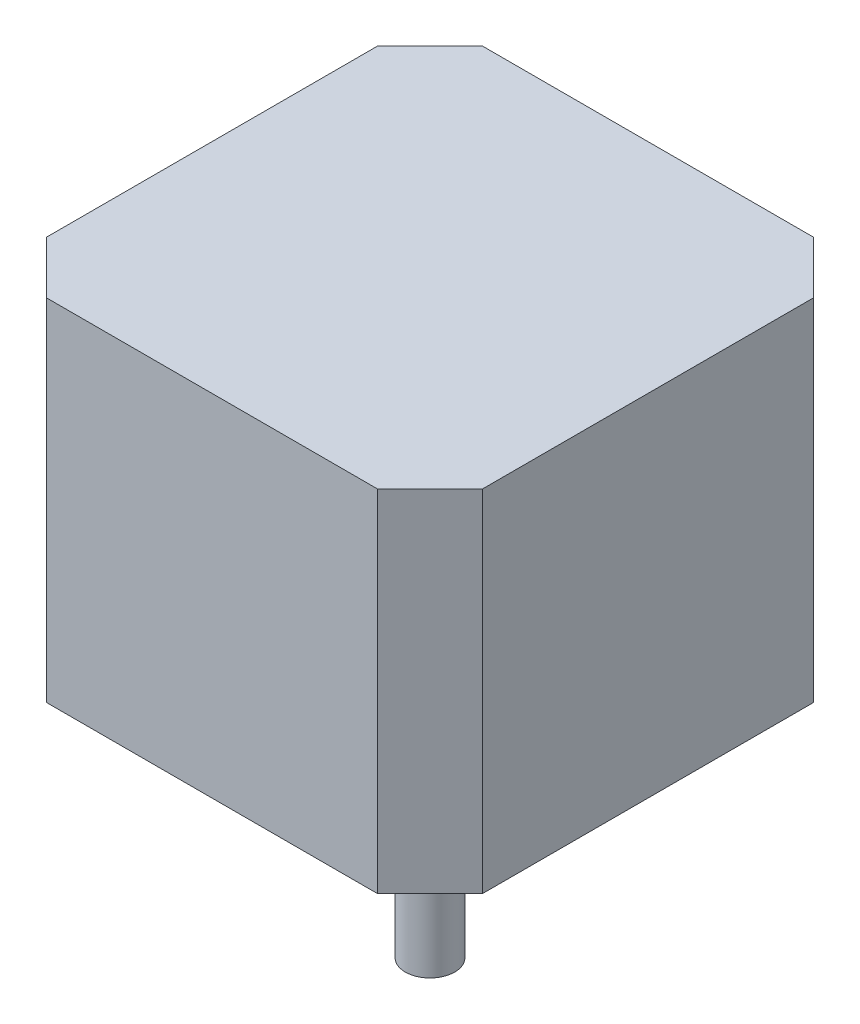
ISO-10303-21;
HEADER;
FILE_DESCRIPTION(('STEP AP214'),'2;1');
FILE_NAME('part.step','',(''),(''),'','','');
FILE_SCHEMA(('AUTOMOTIVE_DESIGN { 1 0 10303 214 1 1 1 1 }'));
ENDSEC;
DATA;
#1=APPLICATION_CONTEXT('core data for automotive mechanical design processes');
#2=APPLICATION_PROTOCOL_DEFINITION('international standard','automotive_design',2000,#1);
#3=PRODUCT_CONTEXT('',#1,'mechanical');
#4=PRODUCT('Part','Part','',(#3));
#5=PRODUCT_RELATED_PRODUCT_CATEGORY('part','',(#4));
#6=PRODUCT_DEFINITION_FORMATION('','',#4);
#7=PRODUCT_DEFINITION_CONTEXT('part definition',#1,'design');
#8=PRODUCT_DEFINITION('design','',#6,#7);
#9=PRODUCT_DEFINITION_SHAPE('','',#8);
#10=(LENGTH_UNIT() NAMED_UNIT(*) SI_UNIT(.MILLI.,.METRE.));
#11=(NAMED_UNIT(*) PLANE_ANGLE_UNIT() SI_UNIT($,.RADIAN.));
#12=(NAMED_UNIT(*) SI_UNIT($,.STERADIAN.) SOLID_ANGLE_UNIT());
#13=UNCERTAINTY_MEASURE_WITH_UNIT(LENGTH_MEASURE(1.E-05),#10,'distance_accuracy_value','');
#14=(GEOMETRIC_REPRESENTATION_CONTEXT(3) GLOBAL_UNCERTAINTY_ASSIGNED_CONTEXT((#13)) GLOBAL_UNIT_ASSIGNED_CONTEXT((#10,
#11,#12)) REPRESENTATION_CONTEXT('',''));
#15=CARTESIAN_POINT('',(0.,0.,0.));
#16=DIRECTION('',(0.,0.,1.));
#17=DIRECTION('',(1.,0.,0.));
#18=AXIS2_PLACEMENT_3D('',#15,#16,#17);
#19=CARTESIAN_POINT('',(-21.15,34.,-16.07));
#20=DIRECTION('',(0.707106781186547,0.,0.707106781186548));
#21=DIRECTION('',(0.707106781186548,0.,-0.707106781186547));
#22=AXIS2_PLACEMENT_3D('',#19,#20,#21);
#23=PLANE('',#22);
#24=DIRECTION('',(-0.707106781186548,0.,0.707106781186547));
#25=VECTOR('',#24,1.);
#26=CARTESIAN_POINT('',(-21.15,0.,-16.07));
#27=LINE('',#26,#25);
#28=CARTESIAN_POINT('',(-16.07,0.,-21.15));
#29=VERTEX_POINT('',#28);
#30=CARTESIAN_POINT('',(-21.15,0.,-16.07));
#31=VERTEX_POINT('',#30);
#32=EDGE_CURVE('E149',#29,#31,#27,.T.);
#33=ORIENTED_EDGE('',*,*,#32,.T.);
#34=DIRECTION('',(0.,-1.,0.));
#35=VECTOR('',#34,1.);
#36=CARTESIAN_POINT('',(-21.15,34.,-16.07));
#37=LINE('',#36,#35);
#38=CARTESIAN_POINT('',(-21.15,34.,-16.07));
#39=VERTEX_POINT('',#38);
#40=EDGE_CURVE('E44',#39,#31,#37,.T.);
#41=ORIENTED_EDGE('',*,*,#40,.F.);
#42=DIRECTION('',(-0.707106781186548,0.,0.707106781186547));
#43=VECTOR('',#42,1.);
#44=CARTESIAN_POINT('',(-21.15,34.,-16.07));
#45=LINE('',#44,#43);
#46=CARTESIAN_POINT('',(-16.07,34.,-21.15));
#47=VERTEX_POINT('',#46);
#48=EDGE_CURVE('E165',#47,#39,#45,.T.);
#49=ORIENTED_EDGE('',*,*,#48,.F.);
#50=DIRECTION('',(0.,-1.,0.));
#51=VECTOR('',#50,1.);
#52=CARTESIAN_POINT('',(-16.07,34.,-21.15));
#53=LINE('',#52,#51);
#54=EDGE_CURVE('E145',#47,#29,#53,.T.);
#55=ORIENTED_EDGE('',*,*,#54,.T.);
#56=EDGE_LOOP('',(#33,#41,#49,#55));
#57=FACE_BOUND('',#56,.T.);
#58=ADVANCED_FACE('F41',(#57),#23,.F.);
#59=CARTESIAN_POINT('',(-21.15,34.,16.07));
#60=DIRECTION('',(1.,0.,0.));
#61=DIRECTION('',(0.,0.,-1.));
#62=AXIS2_PLACEMENT_3D('',#59,#60,#61);
#63=PLANE('',#62);
#64=DIRECTION('',(0.,0.,1.));
#65=VECTOR('',#64,1.);
#66=CARTESIAN_POINT('',(-21.15,0.,16.07));
#67=LINE('',#66,#65);
#68=CARTESIAN_POINT('',(-21.15,0.,16.07));
#69=VERTEX_POINT('',#68);
#70=EDGE_CURVE('E152',#31,#69,#67,.T.);
#71=ORIENTED_EDGE('',*,*,#70,.T.);
#72=DIRECTION('',(0.,-1.,0.));
#73=VECTOR('',#72,1.);
#74=CARTESIAN_POINT('',(-21.15,34.,16.07));
#75=LINE('',#74,#73);
#76=CARTESIAN_POINT('',(-21.15,34.,16.07));
#77=VERTEX_POINT('',#76);
#78=EDGE_CURVE('E174',#77,#69,#75,.T.);
#79=ORIENTED_EDGE('',*,*,#78,.F.);
#80=DIRECTION('',(0.,0.,1.));
#81=VECTOR('',#80,1.);
#82=CARTESIAN_POINT('',(-21.15,34.,16.07));
#83=LINE('',#82,#81);
#84=EDGE_CURVE('E106',#39,#77,#83,.T.);
#85=ORIENTED_EDGE('',*,*,#84,.F.);
#86=ORIENTED_EDGE('',*,*,#40,.T.);
#87=EDGE_LOOP('',(#71,#79,#85,#86));
#88=FACE_BOUND('',#87,.T.);
#89=ADVANCED_FACE('F180',(#88),#63,.F.);
#90=CARTESIAN_POINT('',(-16.07,34.,21.15));
#91=DIRECTION('',(0.707106781186547,0.,-0.707106781186547));
#92=DIRECTION('',(-0.707106781186548,0.,-0.707106781186548));
#93=AXIS2_PLACEMENT_3D('',#90,#91,#92);
#94=PLANE('',#93);
#95=DIRECTION('',(0.707106781186548,0.,0.707106781186548));
#96=VECTOR('',#95,1.);
#97=CARTESIAN_POINT('',(-16.07,0.,21.15));
#98=LINE('',#97,#96);
#99=CARTESIAN_POINT('',(-16.07,0.,21.15));
#100=VERTEX_POINT('',#99);
#101=EDGE_CURVE('E155',#69,#100,#98,.T.);
#102=ORIENTED_EDGE('',*,*,#101,.T.);
#103=DIRECTION('',(0.,-1.,0.));
#104=VECTOR('',#103,1.);
#105=CARTESIAN_POINT('',(-16.07,34.,21.15));
#106=LINE('',#105,#104);
#107=CARTESIAN_POINT('',(-16.07,34.,21.15));
#108=VERTEX_POINT('',#107);
#109=EDGE_CURVE('E172',#108,#100,#106,.T.);
#110=ORIENTED_EDGE('',*,*,#109,.F.);
#111=DIRECTION('',(0.707106781186548,0.,0.707106781186548));
#112=VECTOR('',#111,1.);
#113=CARTESIAN_POINT('',(-16.07,34.,21.15));
#114=LINE('',#113,#112);
#115=EDGE_CURVE('E195',#77,#108,#114,.T.);
#116=ORIENTED_EDGE('',*,*,#115,.F.);
#117=ORIENTED_EDGE('',*,*,#78,.T.);
#118=EDGE_LOOP('',(#102,#110,#116,#117));
#119=FACE_BOUND('',#118,.T.);
#120=ADVANCED_FACE('F189',(#119),#94,.F.);
#121=CARTESIAN_POINT('',(16.07,34.,21.15));
#122=DIRECTION('',(0.,0.,-1.));
#123=DIRECTION('',(-1.,0.,0.));
#124=AXIS2_PLACEMENT_3D('',#121,#122,#123);
#125=PLANE('',#124);
#126=DIRECTION('',(1.,0.,0.));
#127=VECTOR('',#126,1.);
#128=CARTESIAN_POINT('',(16.07,0.,21.15));
#129=LINE('',#128,#127);
#130=CARTESIAN_POINT('',(16.07,0.,21.15));
#131=VERTEX_POINT('',#130);
#132=EDGE_CURVE('E157',#100,#131,#129,.T.);
#133=ORIENTED_EDGE('',*,*,#132,.T.);
#134=DIRECTION('',(0.,-1.,0.));
#135=VECTOR('',#134,1.);
#136=CARTESIAN_POINT('',(16.07,34.,21.15));
#137=LINE('',#136,#135);
#138=CARTESIAN_POINT('',(16.07,34.,21.15));
#139=VERTEX_POINT('',#138);
#140=EDGE_CURVE('E169',#139,#131,#137,.T.);
#141=ORIENTED_EDGE('',*,*,#140,.F.);
#142=DIRECTION('',(1.,0.,0.));
#143=VECTOR('',#142,1.);
#144=CARTESIAN_POINT('',(16.07,34.,21.15));
#145=LINE('',#144,#143);
#146=EDGE_CURVE('E194',#108,#139,#145,.T.);
#147=ORIENTED_EDGE('',*,*,#146,.F.);
#148=ORIENTED_EDGE('',*,*,#109,.T.);
#149=EDGE_LOOP('',(#133,#141,#147,#148));
#150=FACE_BOUND('',#149,.T.);
#151=ADVANCED_FACE('F192',(#150),#125,.F.);
#152=CARTESIAN_POINT('',(21.15,34.,16.07));
#153=DIRECTION('',(-0.707106781186548,0.,-0.707106781186547));
#154=DIRECTION('',(-0.707106781186547,0.,0.707106781186548));
#155=AXIS2_PLACEMENT_3D('',#152,#153,#154);
#156=PLANE('',#155);
#157=DIRECTION('',(0.707106781186547,0.,-0.707106781186548));
#158=VECTOR('',#157,1.);
#159=CARTESIAN_POINT('',(21.15,0.,16.07));
#160=LINE('',#159,#158);
#161=CARTESIAN_POINT('',(21.15,0.,16.07));
#162=VERTEX_POINT('',#161);
#163=EDGE_CURVE('E159',#131,#162,#160,.T.);
#164=ORIENTED_EDGE('',*,*,#163,.T.);
#165=DIRECTION('',(0.,-1.,0.));
#166=VECTOR('',#165,1.);
#167=CARTESIAN_POINT('',(21.15,34.,16.07));
#168=LINE('',#167,#166);
#169=CARTESIAN_POINT('',(21.15,34.,16.07));
#170=VERTEX_POINT('',#169);
#171=EDGE_CURVE('E140',#170,#162,#168,.T.);
#172=ORIENTED_EDGE('',*,*,#171,.F.);
#173=DIRECTION('',(0.707106781186547,0.,-0.707106781186548));
#174=VECTOR('',#173,1.);
#175=CARTESIAN_POINT('',(21.15,34.,16.07));
#176=LINE('',#175,#174);
#177=EDGE_CURVE('E128',#139,#170,#176,.T.);
#178=ORIENTED_EDGE('',*,*,#177,.F.);
#179=ORIENTED_EDGE('',*,*,#140,.T.);
#180=EDGE_LOOP('',(#164,#172,#178,#179));
#181=FACE_BOUND('',#180,.T.);
#182=ADVANCED_FACE('F303',(#181),#156,.F.);
#183=CARTESIAN_POINT('',(21.15,34.,-16.07));
#184=DIRECTION('',(-1.,0.,0.));
#185=DIRECTION('',(0.,0.,1.));
#186=AXIS2_PLACEMENT_3D('',#183,#184,#185);
#187=PLANE('',#186);
#188=DIRECTION('',(0.,0.,-1.));
#189=VECTOR('',#188,1.);
#190=CARTESIAN_POINT('',(21.15,0.,-16.07));
#191=LINE('',#190,#189);
#192=CARTESIAN_POINT('',(21.15,0.,-16.07));
#193=VERTEX_POINT('',#192);
#194=EDGE_CURVE('E137',#162,#193,#191,.T.);
#195=ORIENTED_EDGE('',*,*,#194,.T.);
#196=DIRECTION('',(0.,-1.,0.));
#197=VECTOR('',#196,1.);
#198=CARTESIAN_POINT('',(21.15,34.,-16.07));
#199=LINE('',#198,#197);
#200=CARTESIAN_POINT('',(21.15,34.,-16.07));
#201=VERTEX_POINT('',#200);
#202=EDGE_CURVE('E134',#201,#193,#199,.T.);
#203=ORIENTED_EDGE('',*,*,#202,.F.);
#204=DIRECTION('',(0.,0.,-1.));
#205=VECTOR('',#204,1.);
#206=CARTESIAN_POINT('',(21.15,34.,-16.07));
#207=LINE('',#206,#205);
#208=EDGE_CURVE('E121',#170,#201,#207,.T.);
#209=ORIENTED_EDGE('',*,*,#208,.F.);
#210=ORIENTED_EDGE('',*,*,#171,.T.);
#211=EDGE_LOOP('',(#195,#203,#209,#210));
#212=FACE_BOUND('',#211,.T.);
#213=ADVANCED_FACE('F135',(#212),#187,.F.);
#214=CARTESIAN_POINT('',(16.07,34.,-21.15));
#215=DIRECTION('',(-0.707106781186548,0.,0.707106781186547));
#216=DIRECTION('',(0.707106781186547,0.,0.707106781186548));
#217=AXIS2_PLACEMENT_3D('',#214,#215,#216);
#218=PLANE('',#217);
#219=DIRECTION('',(-0.707106781186547,0.,-0.707106781186548));
#220=VECTOR('',#219,1.);
#221=CARTESIAN_POINT('',(16.07,0.,-21.15));
#222=LINE('',#221,#220);
#223=CARTESIAN_POINT('',(16.07,0.,-21.15));
#224=VERTEX_POINT('',#223);
#225=EDGE_CURVE('E162',#193,#224,#222,.T.);
#226=ORIENTED_EDGE('',*,*,#225,.T.);
#227=DIRECTION('',(0.,-1.,0.));
#228=VECTOR('',#227,1.);
#229=CARTESIAN_POINT('',(16.07,34.,-21.15));
#230=LINE('',#229,#228);
#231=CARTESIAN_POINT('',(16.07,34.,-21.15));
#232=VERTEX_POINT('',#231);
#233=EDGE_CURVE('E141',#232,#224,#230,.T.);
#234=ORIENTED_EDGE('',*,*,#233,.F.);
#235=DIRECTION('',(-0.707106781186547,0.,-0.707106781186548));
#236=VECTOR('',#235,1.);
#237=CARTESIAN_POINT('',(16.07,34.,-21.15));
#238=LINE('',#237,#236);
#239=EDGE_CURVE('E125',#201,#232,#238,.T.);
#240=ORIENTED_EDGE('',*,*,#239,.F.);
#241=ORIENTED_EDGE('',*,*,#202,.T.);
#242=EDGE_LOOP('',(#226,#234,#240,#241));
#243=FACE_BOUND('',#242,.T.);
#244=ADVANCED_FACE('F143',(#243),#218,.F.);
#245=CARTESIAN_POINT('',(-16.07,34.,-21.15));
#246=DIRECTION('',(0.,0.,1.));
#247=DIRECTION('',(1.,0.,0.));
#248=AXIS2_PLACEMENT_3D('',#245,#246,#247);
#249=PLANE('',#248);
#250=DIRECTION('',(-1.,0.,0.));
#251=VECTOR('',#250,1.);
#252=CARTESIAN_POINT('',(-16.07,0.,-21.15));
#253=LINE('',#252,#251);
#254=EDGE_CURVE('E97',#224,#29,#253,.T.);
#255=ORIENTED_EDGE('',*,*,#254,.T.);
#256=ORIENTED_EDGE('',*,*,#54,.F.);
#257=DIRECTION('',(-1.,0.,0.));
#258=VECTOR('',#257,1.);
#259=CARTESIAN_POINT('',(-16.07,34.,-21.15));
#260=LINE('',#259,#258);
#261=EDGE_CURVE('E64',#232,#47,#260,.T.);
#262=ORIENTED_EDGE('',*,*,#261,.F.);
#263=ORIENTED_EDGE('',*,*,#233,.T.);
#264=EDGE_LOOP('',(#255,#256,#262,#263));
#265=FACE_BOUND('',#264,.T.);
#266=ADVANCED_FACE('F287',(#265),#249,.F.);
#267=CARTESIAN_POINT('',(0.,34.,0.));
#268=DIRECTION('',(0.,-1.,0.));
#269=DIRECTION('',(0.,0.,-1.));
#270=AXIS2_PLACEMENT_3D('',#267,#268,#269);
#271=PLANE('',#270);
#272=ORIENTED_EDGE('',*,*,#48,.T.);
#273=ORIENTED_EDGE('',*,*,#84,.T.);
#274=ORIENTED_EDGE('',*,*,#115,.T.);
#275=ORIENTED_EDGE('',*,*,#146,.T.);
#276=ORIENTED_EDGE('',*,*,#177,.T.);
#277=ORIENTED_EDGE('',*,*,#208,.T.);
#278=ORIENTED_EDGE('',*,*,#239,.T.);
#279=ORIENTED_EDGE('',*,*,#261,.T.);
#280=EDGE_LOOP('',(#272,#273,#274,#275,#276,#277,#278,#279));
#281=FACE_BOUND('',#280,.T.);
#282=ADVANCED_FACE('F123',(#281),#271,.F.);
#283=CARTESIAN_POINT('',(0.,0.,0.));
#284=DIRECTION('',(0.,-1.,0.));
#285=DIRECTION('',(0.,0.,-1.));
#286=AXIS2_PLACEMENT_3D('',#283,#284,#285);
#287=PLANE('',#286);
#288=CARTESIAN_POINT('',(0.,0.,0.));
#289=DIRECTION('',(0.,-1.,0.));
#290=DIRECTION('',(0.,0.,-1.));
#291=AXIS2_PLACEMENT_3D('',#288,#289,#290);
#292=CIRCLE('',#291,11.);
#293=CARTESIAN_POINT('',(0.,0.,-11.));
#294=VERTEX_POINT('',#293);
#295=EDGE_CURVE('E11',#294,#294,#292,.T.);
#296=ORIENTED_EDGE('',*,*,#295,.F.);
#297=EDGE_LOOP('',(#296));
#298=FACE_BOUND('',#297,.T.);
#299=CARTESIAN_POINT('',(15.5,0.,-15.5));
#300=DIRECTION('',(0.,-1.,0.));
#301=DIRECTION('',(0.,0.,-1.));
#302=AXIS2_PLACEMENT_3D('',#299,#300,#301);
#303=CIRCLE('',#302,1.24999999999999);
#304=CARTESIAN_POINT('',(15.5,0.,-16.75));
#305=VERTEX_POINT('',#304);
#306=EDGE_CURVE('E221',#305,#305,#303,.T.);
#307=ORIENTED_EDGE('',*,*,#306,.F.);
#308=EDGE_LOOP('',(#307));
#309=FACE_BOUND('',#308,.T.);
#310=CARTESIAN_POINT('',(-15.5,0.,-15.5));
#311=DIRECTION('',(0.,-1.,0.));
#312=DIRECTION('',(0.,0.,-1.));
#313=AXIS2_PLACEMENT_3D('',#310,#311,#312);
#314=CIRCLE('',#313,1.24999999999999);
#315=CARTESIAN_POINT('',(-15.5,0.,-16.75));
#316=VERTEX_POINT('',#315);
#317=EDGE_CURVE('E215',#316,#316,#314,.T.);
#318=ORIENTED_EDGE('',*,*,#317,.F.);
#319=EDGE_LOOP('',(#318));
#320=FACE_BOUND('',#319,.T.);
#321=CARTESIAN_POINT('',(-15.5,0.,15.5));
#322=DIRECTION('',(0.,-1.,0.));
#323=DIRECTION('',(0.,0.,-1.));
#324=AXIS2_PLACEMENT_3D('',#321,#322,#323);
#325=CIRCLE('',#324,1.24999999999999);
#326=CARTESIAN_POINT('',(-15.5,0.,14.25));
#327=VERTEX_POINT('',#326);
#328=EDGE_CURVE('E209',#327,#327,#325,.T.);
#329=ORIENTED_EDGE('',*,*,#328,.F.);
#330=EDGE_LOOP('',(#329));
#331=FACE_BOUND('',#330,.T.);
#332=CARTESIAN_POINT('',(15.5,0.,15.5));
#333=DIRECTION('',(0.,-1.,0.));
#334=DIRECTION('',(0.,0.,-1.));
#335=AXIS2_PLACEMENT_3D('',#332,#333,#334);
#336=CIRCLE('',#335,1.24999999999999);
#337=CARTESIAN_POINT('',(15.5,0.,14.25));
#338=VERTEX_POINT('',#337);
#339=EDGE_CURVE('E203',#338,#338,#336,.T.);
#340=ORIENTED_EDGE('',*,*,#339,.F.);
#341=EDGE_LOOP('',(#340));
#342=FACE_BOUND('',#341,.T.);
#343=ORIENTED_EDGE('',*,*,#32,.F.);
#344=ORIENTED_EDGE('',*,*,#254,.F.);
#345=ORIENTED_EDGE('',*,*,#225,.F.);
#346=ORIENTED_EDGE('',*,*,#194,.F.);
#347=ORIENTED_EDGE('',*,*,#163,.F.);
#348=ORIENTED_EDGE('',*,*,#132,.F.);
#349=ORIENTED_EDGE('',*,*,#101,.F.);
#350=ORIENTED_EDGE('',*,*,#70,.F.);
#351=EDGE_LOOP('',(#343,#344,#345,#346,#347,#348,#349,#350));
#352=FACE_BOUND('',#351,.T.);
#353=ADVANCED_FACE('F185',(#298,#309,#320,#331,#342,#352),#287,.T.);
#354=CARTESIAN_POINT('',(15.5,4.499991,15.5));
#355=DIRECTION('',(0.,-1.,0.));
#356=DIRECTION('',(0.,0.,-1.));
#357=AXIS2_PLACEMENT_3D('',#354,#355,#356);
#358=CONICAL_SURFACE('',#357,1.25,1.02974425867665);
#359=CARTESIAN_POINT('',(15.5,5.25106677378445,15.5));
#360=VERTEX_POINT('',#359);
#361=VERTEX_LOOP('',#360);
#362=FACE_BOUND('',#361,.T.);
#363=CARTESIAN_POINT('',(15.5,4.499991,15.5));
#364=DIRECTION('',(0.,-1.,0.));
#365=DIRECTION('',(0.,0.,-1.));
#366=AXIS2_PLACEMENT_3D('',#363,#364,#365);
#367=CIRCLE('',#366,1.25);
#368=CARTESIAN_POINT('',(15.5,4.499991,14.25));
#369=VERTEX_POINT('',#368);
#370=EDGE_CURVE('E153',#369,#369,#367,.T.);
#371=ORIENTED_EDGE('',*,*,#370,.T.);
#372=EDGE_LOOP('',(#371));
#373=FACE_BOUND('',#372,.T.);
#374=ADVANCED_FACE('F268',(#362,#373),#358,.F.);
#375=CARTESIAN_POINT('',(15.5,0.,15.5));
#376=DIRECTION('',(0.,-1.,0.));
#377=DIRECTION('',(0.,0.,-1.));
#378=AXIS2_PLACEMENT_3D('',#375,#376,#377);
#379=CYLINDRICAL_SURFACE('',#378,1.24999999999999);
#380=ORIENTED_EDGE('',*,*,#370,.F.);
#381=EDGE_LOOP('',(#380));
#382=FACE_BOUND('',#381,.T.);
#383=ORIENTED_EDGE('',*,*,#339,.T.);
#384=EDGE_LOOP('',(#383));
#385=FACE_BOUND('',#384,.T.);
#386=ADVANCED_FACE('F271',(#382,#385),#379,.F.);
#387=CARTESIAN_POINT('',(-15.5,4.499991,15.5));
#388=DIRECTION('',(0.,-1.,0.));
#389=DIRECTION('',(0.,0.,-1.));
#390=AXIS2_PLACEMENT_3D('',#387,#388,#389);
#391=CONICAL_SURFACE('',#390,1.25,1.02974425867665);
#392=CARTESIAN_POINT('',(-15.5,5.25106677378445,15.5));
#393=VERTEX_POINT('',#392);
#394=VERTEX_LOOP('',#393);
#395=FACE_BOUND('',#394,.T.);
#396=CARTESIAN_POINT('',(-15.5,4.499991,15.5));
#397=DIRECTION('',(0.,-1.,0.));
#398=DIRECTION('',(0.,0.,-1.));
#399=AXIS2_PLACEMENT_3D('',#396,#397,#398);
#400=CIRCLE('',#399,1.25);
#401=CARTESIAN_POINT('',(-15.5,4.499991,14.25));
#402=VERTEX_POINT('',#401);
#403=EDGE_CURVE('E206',#402,#402,#400,.T.);
#404=ORIENTED_EDGE('',*,*,#403,.T.);
#405=EDGE_LOOP('',(#404));
#406=FACE_BOUND('',#405,.T.);
#407=ADVANCED_FACE('F277',(#395,#406),#391,.F.);
#408=CARTESIAN_POINT('',(-15.5,0.,15.5));
#409=DIRECTION('',(0.,-1.,0.));
#410=DIRECTION('',(0.,0.,-1.));
#411=AXIS2_PLACEMENT_3D('',#408,#409,#410);
#412=CYLINDRICAL_SURFACE('',#411,1.24999999999999);
#413=ORIENTED_EDGE('',*,*,#403,.F.);
#414=EDGE_LOOP('',(#413));
#415=FACE_BOUND('',#414,.T.);
#416=ORIENTED_EDGE('',*,*,#328,.T.);
#417=EDGE_LOOP('',(#416));
#418=FACE_BOUND('',#417,.T.);
#419=ADVANCED_FACE('F344',(#415,#418),#412,.F.);
#420=CARTESIAN_POINT('',(-15.5,4.499991,-15.5));
#421=DIRECTION('',(0.,-1.,0.));
#422=DIRECTION('',(0.,0.,-1.));
#423=AXIS2_PLACEMENT_3D('',#420,#421,#422);
#424=CONICAL_SURFACE('',#423,1.25,1.02974425867665);
#425=CARTESIAN_POINT('',(-15.5,5.25106677378445,-15.5));
#426=VERTEX_POINT('',#425);
#427=VERTEX_LOOP('',#426);
#428=FACE_BOUND('',#427,.T.);
#429=CARTESIAN_POINT('',(-15.5,4.499991,-15.5));
#430=DIRECTION('',(0.,-1.,0.));
#431=DIRECTION('',(0.,0.,-1.));
#432=AXIS2_PLACEMENT_3D('',#429,#430,#431);
#433=CIRCLE('',#432,1.25);
#434=CARTESIAN_POINT('',(-15.5,4.499991,-16.75));
#435=VERTEX_POINT('',#434);
#436=EDGE_CURVE('E212',#435,#435,#433,.T.);
#437=ORIENTED_EDGE('',*,*,#436,.T.);
#438=EDGE_LOOP('',(#437));
#439=FACE_BOUND('',#438,.T.);
#440=ADVANCED_FACE('F353',(#428,#439),#424,.F.);
#441=CARTESIAN_POINT('',(-15.5,0.,-15.5));
#442=DIRECTION('',(0.,-1.,0.));
#443=DIRECTION('',(0.,0.,-1.));
#444=AXIS2_PLACEMENT_3D('',#441,#442,#443);
#445=CYLINDRICAL_SURFACE('',#444,1.24999999999999);
#446=ORIENTED_EDGE('',*,*,#436,.F.);
#447=EDGE_LOOP('',(#446));
#448=FACE_BOUND('',#447,.T.);
#449=ORIENTED_EDGE('',*,*,#317,.T.);
#450=EDGE_LOOP('',(#449));
#451=FACE_BOUND('',#450,.T.);
#452=ADVANCED_FACE('F365',(#448,#451),#445,.F.);
#453=CARTESIAN_POINT('',(15.5,4.499991,-15.5));
#454=DIRECTION('',(0.,-1.,0.));
#455=DIRECTION('',(0.,0.,-1.));
#456=AXIS2_PLACEMENT_3D('',#453,#454,#455);
#457=CONICAL_SURFACE('',#456,1.25,1.02974425867665);
#458=CARTESIAN_POINT('',(15.5,5.25106677378445,-15.5));
#459=VERTEX_POINT('',#458);
#460=VERTEX_LOOP('',#459);
#461=FACE_BOUND('',#460,.T.);
#462=CARTESIAN_POINT('',(15.5,4.499991,-15.5));
#463=DIRECTION('',(0.,-1.,0.));
#464=DIRECTION('',(0.,0.,-1.));
#465=AXIS2_PLACEMENT_3D('',#462,#463,#464);
#466=CIRCLE('',#465,1.25);
#467=CARTESIAN_POINT('',(15.5,4.499991,-16.75));
#468=VERTEX_POINT('',#467);
#469=EDGE_CURVE('E218',#468,#468,#466,.T.);
#470=ORIENTED_EDGE('',*,*,#469,.T.);
#471=EDGE_LOOP('',(#470));
#472=FACE_BOUND('',#471,.T.);
#473=ADVANCED_FACE('F375',(#461,#472),#457,.F.);
#474=CARTESIAN_POINT('',(15.5,0.,-15.5));
#475=DIRECTION('',(0.,-1.,0.));
#476=DIRECTION('',(0.,0.,-1.));
#477=AXIS2_PLACEMENT_3D('',#474,#475,#476);
#478=CYLINDRICAL_SURFACE('',#477,1.24999999999999);
#479=ORIENTED_EDGE('',*,*,#469,.F.);
#480=EDGE_LOOP('',(#479));
#481=FACE_BOUND('',#480,.T.);
#482=ORIENTED_EDGE('',*,*,#306,.T.);
#483=EDGE_LOOP('',(#482));
#484=FACE_BOUND('',#483,.T.);
#485=ADVANCED_FACE('F387',(#481,#484),#478,.F.);
#486=CARTESIAN_POINT('',(0.,-2.,0.));
#487=DIRECTION('',(0.,1.,0.));
#488=DIRECTION('',(0.,0.,1.));
#489=AXIS2_PLACEMENT_3D('',#486,#487,#488);
#490=CYLINDRICAL_SURFACE('',#489,11.);
#491=CARTESIAN_POINT('',(0.,-2.,0.));
#492=DIRECTION('',(0.,-1.,0.));
#493=DIRECTION('',(0.,0.,-1.));
#494=AXIS2_PLACEMENT_3D('',#491,#492,#493);
#495=CIRCLE('',#494,11.);
#496=CARTESIAN_POINT('',(0.,-2.,-11.));
#497=VERTEX_POINT('',#496);
#498=EDGE_CURVE('E223',#497,#497,#495,.T.);
#499=ORIENTED_EDGE('',*,*,#498,.F.);
#500=EDGE_LOOP('',(#499));
#501=FACE_BOUND('',#500,.T.);
#502=ORIENTED_EDGE('',*,*,#295,.T.);
#503=EDGE_LOOP('',(#502));
#504=FACE_BOUND('',#503,.T.);
#505=ADVANCED_FACE('F396',(#501,#504),#490,.T.);
#506=CARTESIAN_POINT('',(0.,-2.,0.));
#507=DIRECTION('',(0.,-1.,0.));
#508=DIRECTION('',(0.,0.,-1.));
#509=AXIS2_PLACEMENT_3D('',#506,#507,#508);
#510=PLANE('',#509);
#511=CARTESIAN_POINT('',(0.,-2.,0.));
#512=DIRECTION('',(0.,-1.,0.));
#513=DIRECTION('',(0.,0.,-1.));
#514=AXIS2_PLACEMENT_3D('',#511,#512,#513);
#515=CIRCLE('',#514,2.39600473839404);
#516=CARTESIAN_POINT('',(1.524,-2.,-1.84885443083189));
#517=VERTEX_POINT('',#516);
#518=CARTESIAN_POINT('',(-1.524,-2.,-1.84885443083189));
#519=VERTEX_POINT('',#518);
#520=EDGE_CURVE('E235',#517,#519,#515,.T.);
#521=ORIENTED_EDGE('',*,*,#520,.F.);
#522=DIRECTION('',(1.,0.,0.));
#523=VECTOR('',#522,1.);
#524=CARTESIAN_POINT('',(1.524,-2.,-1.84885443083189));
#525=LINE('',#524,#523);
#526=EDGE_CURVE('E55',#519,#517,#525,.T.);
#527=ORIENTED_EDGE('',*,*,#526,.F.);
#528=EDGE_LOOP('',(#521,#527));
#529=FACE_BOUND('',#528,.T.);
#530=ORIENTED_EDGE('',*,*,#498,.T.);
#531=EDGE_LOOP('',(#530));
#532=FACE_BOUND('',#531,.T.);
#533=ADVANCED_FACE('F411',(#529,#532),#510,.T.);
#534=CARTESIAN_POINT('',(0.,-24.,0.));
#535=DIRECTION('',(0.,1.,0.));
#536=DIRECTION('',(0.,0.,1.));
#537=AXIS2_PLACEMENT_3D('',#534,#535,#536);
#538=CYLINDRICAL_SURFACE('',#537,2.39600473839404);
#539=ORIENTED_EDGE('',*,*,#520,.T.);
#540=DIRECTION('',(0.,1.,0.));
#541=VECTOR('',#540,1.);
#542=CARTESIAN_POINT('',(-1.524,-24.,-1.84885443083189));
#543=LINE('',#542,#541);
#544=CARTESIAN_POINT('',(-1.524,-24.,-1.84885443083189));
#545=VERTEX_POINT('',#544);
#546=EDGE_CURVE('E227',#545,#519,#543,.T.);
#547=ORIENTED_EDGE('',*,*,#546,.F.);
#548=CARTESIAN_POINT('',(0.,-24.,0.));
#549=DIRECTION('',(0.,-1.,0.));
#550=DIRECTION('',(0.,0.,-1.));
#551=AXIS2_PLACEMENT_3D('',#548,#549,#550);
#552=CIRCLE('',#551,2.39600473839404);
#553=CARTESIAN_POINT('',(1.524,-24.,-1.84885443083189));
#554=VERTEX_POINT('',#553);
#555=EDGE_CURVE('E234',#554,#545,#552,.T.);
#556=ORIENTED_EDGE('',*,*,#555,.F.);
#557=DIRECTION('',(0.,1.,0.));
#558=VECTOR('',#557,1.);
#559=CARTESIAN_POINT('',(1.524,-24.,-1.84885443083189));
#560=LINE('',#559,#558);
#561=EDGE_CURVE('E229',#554,#517,#560,.T.);
#562=ORIENTED_EDGE('',*,*,#561,.T.);
#563=EDGE_LOOP('',(#539,#547,#556,#562));
#564=FACE_BOUND('',#563,.T.);
#565=ADVANCED_FACE('F252',(#564),#538,.T.);
#566=CARTESIAN_POINT('',(1.524,-24.,-1.84885443083189));
#567=DIRECTION('',(0.,0.,1.));
#568=DIRECTION('',(1.,0.,0.));
#569=AXIS2_PLACEMENT_3D('',#566,#567,#568);
#570=PLANE('',#569);
#571=ORIENTED_EDGE('',*,*,#526,.T.);
#572=ORIENTED_EDGE('',*,*,#561,.F.);
#573=DIRECTION('',(1.,0.,0.));
#574=VECTOR('',#573,1.);
#575=CARTESIAN_POINT('',(1.524,-24.,-1.84885443083189));
#576=LINE('',#575,#574);
#577=EDGE_CURVE('E232',#545,#554,#576,.T.);
#578=ORIENTED_EDGE('',*,*,#577,.F.);
#579=ORIENTED_EDGE('',*,*,#546,.T.);
#580=EDGE_LOOP('',(#571,#572,#578,#579));
#581=FACE_BOUND('',#580,.T.);
#582=ADVANCED_FACE('F254',(#581),#570,.F.);
#583=CARTESIAN_POINT('',(0.,-24.,0.));
#584=DIRECTION('',(0.,-1.,0.));
#585=DIRECTION('',(0.,0.,-1.));
#586=AXIS2_PLACEMENT_3D('',#583,#584,#585);
#587=PLANE('',#586);
#588=ORIENTED_EDGE('',*,*,#555,.T.);
#589=ORIENTED_EDGE('',*,*,#577,.T.);
#590=EDGE_LOOP('',(#588,#589));
#591=FACE_BOUND('',#590,.T.);
#592=ADVANCED_FACE('F245',(#591),#587,.T.);
#593=CLOSED_SHELL('',(#58,#89,#120,#151,#182,#213,#244,#266,#282,#353,#374,#386,#407,#419,#440,
#452,#473,#485,#505,#533,#565,#582,#592));
#594=MANIFOLD_SOLID_BREP('B2',#593);
#595=ADVANCED_BREP_SHAPE_REPRESENTATION('',(#18,#594),#14);
#596=SHAPE_DEFINITION_REPRESENTATION(#9,#595);
ENDSEC;
END-ISO-10303-21;
